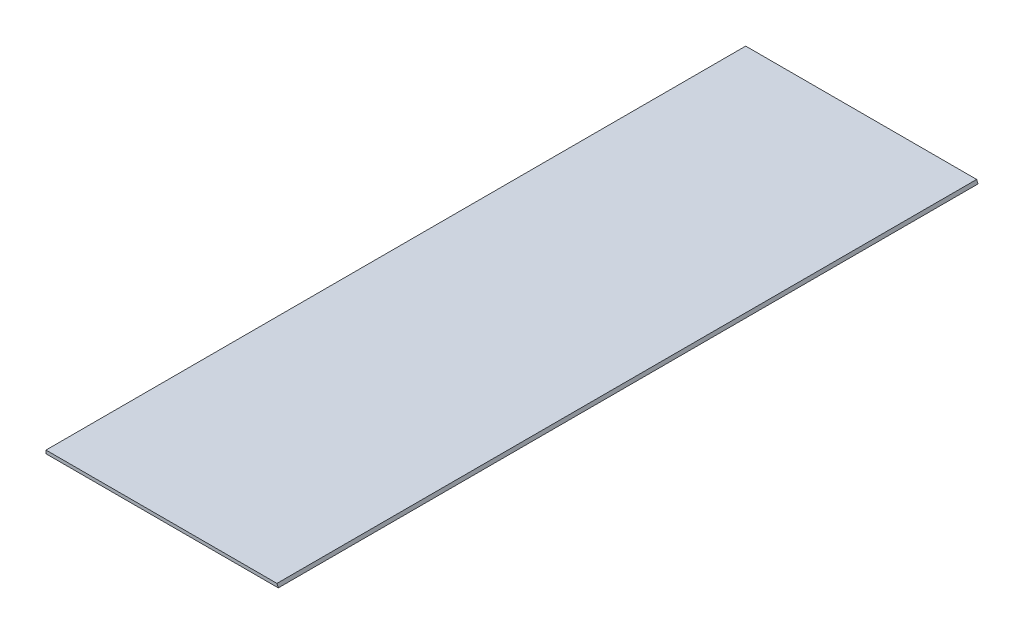
ISO-10303-21;
HEADER;
FILE_DESCRIPTION(('STEP AP214'),'2;1');
FILE_NAME('part.step','',(''),(''),'','','');
FILE_SCHEMA(('AUTOMOTIVE_DESIGN { 1 0 10303 214 1 1 1 1 }'));
ENDSEC;
DATA;
#1=APPLICATION_CONTEXT('core data for automotive mechanical design processes');
#2=APPLICATION_PROTOCOL_DEFINITION('international standard','automotive_design',2000,#1);
#3=PRODUCT_CONTEXT('',#1,'mechanical');
#4=PRODUCT('Part','Part','',(#3));
#5=PRODUCT_RELATED_PRODUCT_CATEGORY('part','',(#4));
#6=PRODUCT_DEFINITION_FORMATION('','',#4);
#7=PRODUCT_DEFINITION_CONTEXT('part definition',#1,'design');
#8=PRODUCT_DEFINITION('design','',#6,#7);
#9=PRODUCT_DEFINITION_SHAPE('','',#8);
#10=(LENGTH_UNIT() NAMED_UNIT(*) SI_UNIT(.MILLI.,.METRE.));
#11=(NAMED_UNIT(*) PLANE_ANGLE_UNIT() SI_UNIT($,.RADIAN.));
#12=(NAMED_UNIT(*) SI_UNIT($,.STERADIAN.) SOLID_ANGLE_UNIT());
#13=UNCERTAINTY_MEASURE_WITH_UNIT(LENGTH_MEASURE(1.E-05),#10,'distance_accuracy_value','');
#14=(GEOMETRIC_REPRESENTATION_CONTEXT(3) GLOBAL_UNCERTAINTY_ASSIGNED_CONTEXT((#13)) GLOBAL_UNIT_ASSIGNED_CONTEXT((#10,
#11,#12)) REPRESENTATION_CONTEXT('',''));
#15=CARTESIAN_POINT('',(0.,0.,0.));
#16=DIRECTION('',(0.,0.,1.));
#17=DIRECTION('',(1.,0.,0.));
#18=AXIS2_PLACEMENT_3D('',#15,#16,#17);
#19=CARTESIAN_POINT('',(168.656,0.,508.));
#20=DIRECTION('',(0.,1.,0.));
#21=DIRECTION('',(-1.,0.,0.));
#22=AXIS2_PLACEMENT_3D('',#19,#20,#21);
#23=PLANE('',#22);
#24=DIRECTION('',(1.,0.,0.));
#25=VECTOR('',#24,1.);
#26=CARTESIAN_POINT('',(168.656,0.,0.));
#27=LINE('',#26,#25);
#28=CARTESIAN_POINT('',(0.,0.,0.));
#29=VERTEX_POINT('',#28);
#30=CARTESIAN_POINT('',(168.656,0.,0.));
#31=VERTEX_POINT('',#30);
#32=EDGE_CURVE('E100',#29,#31,#27,.T.);
#33=ORIENTED_EDGE('',*,*,#32,.T.);
#34=DIRECTION('',(0.,0.,-1.));
#35=VECTOR('',#34,1.);
#36=CARTESIAN_POINT('',(168.656,0.,508.));
#37=LINE('',#36,#35);
#38=CARTESIAN_POINT('',(168.656,0.,508.));
#39=VERTEX_POINT('',#38);
#40=EDGE_CURVE('E11',#39,#31,#37,.T.);
#41=ORIENTED_EDGE('',*,*,#40,.F.);
#42=DIRECTION('',(1.,0.,0.));
#43=VECTOR('',#42,1.);
#44=CARTESIAN_POINT('',(168.656,0.,508.));
#45=LINE('',#44,#43);
#46=CARTESIAN_POINT('',(0.,0.,508.));
#47=VERTEX_POINT('',#46);
#48=EDGE_CURVE('E88',#47,#39,#45,.T.);
#49=ORIENTED_EDGE('',*,*,#48,.F.);
#50=DIRECTION('',(0.,0.,-1.));
#51=VECTOR('',#50,1.);
#52=CARTESIAN_POINT('',(0.,0.,508.));
#53=LINE('',#52,#51);
#54=EDGE_CURVE('E96',#47,#29,#53,.T.);
#55=ORIENTED_EDGE('',*,*,#54,.T.);
#56=EDGE_LOOP('',(#33,#41,#49,#55));
#57=FACE_BOUND('',#56,.T.);
#58=ADVANCED_FACE('F37',(#57),#23,.F.);
#59=CARTESIAN_POINT('',(167.677544722962,2.36219999999998,508.));
#60=DIRECTION('',(-0.923879532511283,-0.382683432365099,0.));
#61=DIRECTION('',(0.382683432365099,-0.923879532511283,0.));
#62=AXIS2_PLACEMENT_3D('',#59,#60,#61);
#63=PLANE('',#62);
#64=DIRECTION('',(-0.382683432365098,0.923879532511283,0.));
#65=VECTOR('',#64,1.);
#66=CARTESIAN_POINT('',(167.677544722962,2.36219999999998,0.));
#67=LINE('',#66,#65);
#68=CARTESIAN_POINT('',(167.677544722962,2.36219999999998,0.));
#69=VERTEX_POINT('',#68);
#70=EDGE_CURVE('E92',#31,#69,#67,.T.);
#71=ORIENTED_EDGE('',*,*,#70,.T.);
#72=DIRECTION('',(0.,0.,-1.));
#73=VECTOR('',#72,1.);
#74=CARTESIAN_POINT('',(167.677544722962,2.36219999999998,508.));
#75=LINE('',#74,#73);
#76=CARTESIAN_POINT('',(167.677544722962,2.36219999999998,508.));
#77=VERTEX_POINT('',#76);
#78=EDGE_CURVE('E45',#77,#69,#75,.T.);
#79=ORIENTED_EDGE('',*,*,#78,.F.);
#80=DIRECTION('',(-0.382683432365098,0.923879532511283,0.));
#81=VECTOR('',#80,1.);
#82=CARTESIAN_POINT('',(167.677544722962,2.36219999999998,508.));
#83=LINE('',#82,#81);
#84=EDGE_CURVE('E83',#39,#77,#83,.T.);
#85=ORIENTED_EDGE('',*,*,#84,.F.);
#86=ORIENTED_EDGE('',*,*,#40,.T.);
#87=EDGE_LOOP('',(#71,#79,#85,#86));
#88=FACE_BOUND('',#87,.T.);
#89=ADVANCED_FACE('F91',(#88),#63,.F.);
#90=CARTESIAN_POINT('',(0.,2.36219999999998,508.));
#91=DIRECTION('',(0.,-1.,0.));
#92=DIRECTION('',(0.,0.,-1.));
#93=AXIS2_PLACEMENT_3D('',#90,#91,#92);
#94=PLANE('',#93);
#95=DIRECTION('',(-1.,0.,0.));
#96=VECTOR('',#95,1.);
#97=CARTESIAN_POINT('',(0.,2.36219999999998,0.));
#98=LINE('',#97,#96);
#99=CARTESIAN_POINT('',(0.,2.36219999999998,0.));
#100=VERTEX_POINT('',#99);
#101=EDGE_CURVE('E70',#69,#100,#98,.T.);
#102=ORIENTED_EDGE('',*,*,#101,.T.);
#103=DIRECTION('',(0.,0.,-1.));
#104=VECTOR('',#103,1.);
#105=CARTESIAN_POINT('',(0.,2.36219999999998,508.));
#106=LINE('',#105,#104);
#107=CARTESIAN_POINT('',(0.,2.36219999999998,508.));
#108=VERTEX_POINT('',#107);
#109=EDGE_CURVE('E93',#108,#100,#106,.T.);
#110=ORIENTED_EDGE('',*,*,#109,.F.);
#111=DIRECTION('',(-1.,0.,0.));
#112=VECTOR('',#111,1.);
#113=CARTESIAN_POINT('',(0.,2.36219999999998,508.));
#114=LINE('',#113,#112);
#115=EDGE_CURVE('E86',#77,#108,#114,.T.);
#116=ORIENTED_EDGE('',*,*,#115,.F.);
#117=ORIENTED_EDGE('',*,*,#78,.T.);
#118=EDGE_LOOP('',(#102,#110,#116,#117));
#119=FACE_BOUND('',#118,.T.);
#120=ADVANCED_FACE('F94',(#119),#94,.F.);
#121=CARTESIAN_POINT('',(0.,0.,508.));
#122=DIRECTION('',(1.,0.,0.));
#123=DIRECTION('',(0.,0.,-1.));
#124=AXIS2_PLACEMENT_3D('',#121,#122,#123);
#125=PLANE('',#124);
#126=DIRECTION('',(0.,-1.,0.));
#127=VECTOR('',#126,1.);
#128=CARTESIAN_POINT('',(0.,0.,0.));
#129=LINE('',#128,#127);
#130=EDGE_CURVE('E76',#100,#29,#129,.T.);
#131=ORIENTED_EDGE('',*,*,#130,.T.);
#132=ORIENTED_EDGE('',*,*,#54,.F.);
#133=DIRECTION('',(0.,-1.,0.));
#134=VECTOR('',#133,1.);
#135=CARTESIAN_POINT('',(0.,0.,508.));
#136=LINE('',#135,#134);
#137=EDGE_CURVE('E53',#108,#47,#136,.T.);
#138=ORIENTED_EDGE('',*,*,#137,.F.);
#139=ORIENTED_EDGE('',*,*,#109,.T.);
#140=EDGE_LOOP('',(#131,#132,#138,#139));
#141=FACE_BOUND('',#140,.T.);
#142=ADVANCED_FACE('F107',(#141),#125,.F.);
#143=CARTESIAN_POINT('',(0.,0.,508.));
#144=DIRECTION('',(0.,0.,-1.));
#145=DIRECTION('',(-1.,0.,0.));
#146=AXIS2_PLACEMENT_3D('',#143,#144,#145);
#147=PLANE('',#146);
#148=ORIENTED_EDGE('',*,*,#48,.T.);
#149=ORIENTED_EDGE('',*,*,#84,.T.);
#150=ORIENTED_EDGE('',*,*,#115,.T.);
#151=ORIENTED_EDGE('',*,*,#137,.T.);
#152=EDGE_LOOP('',(#148,#149,#150,#151));
#153=FACE_BOUND('',#152,.T.);
#154=ADVANCED_FACE('F84',(#153),#147,.F.);
#155=CARTESIAN_POINT('',(0.,0.,0.));
#156=DIRECTION('',(0.,0.,-1.));
#157=DIRECTION('',(-1.,0.,0.));
#158=AXIS2_PLACEMENT_3D('',#155,#156,#157);
#159=PLANE('',#158);
#160=ORIENTED_EDGE('',*,*,#32,.F.);
#161=ORIENTED_EDGE('',*,*,#130,.F.);
#162=ORIENTED_EDGE('',*,*,#101,.F.);
#163=ORIENTED_EDGE('',*,*,#70,.F.);
#164=EDGE_LOOP('',(#160,#161,#162,#163));
#165=FACE_BOUND('',#164,.T.);
#166=ADVANCED_FACE('F110',(#165),#159,.T.);
#167=CLOSED_SHELL('',(#58,#89,#120,#142,#154,#166));
#168=MANIFOLD_SOLID_BREP('B2',#167);
#169=ADVANCED_BREP_SHAPE_REPRESENTATION('',(#18,#168),#14);
#170=SHAPE_DEFINITION_REPRESENTATION(#9,#169);
ENDSEC;
END-ISO-10303-21;
